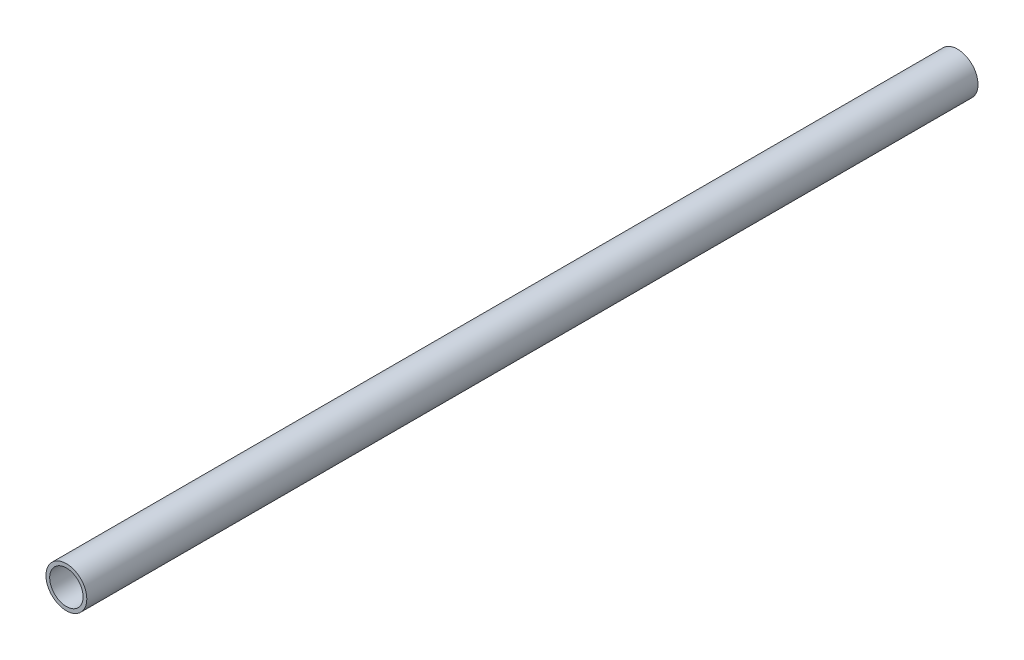
ISO-10303-21;
HEADER;
FILE_DESCRIPTION(('STEP AP214'),'2;1');
FILE_NAME('part.step','',(''),(''),'','','');
FILE_SCHEMA(('AUTOMOTIVE_DESIGN { 1 0 10303 214 1 1 1 1 }'));
ENDSEC;
DATA;
#1=APPLICATION_CONTEXT('core data for automotive mechanical design processes');
#2=APPLICATION_PROTOCOL_DEFINITION('international standard','automotive_design',2000,#1);
#3=PRODUCT_CONTEXT('',#1,'mechanical');
#4=PRODUCT('Part','Part','',(#3));
#5=PRODUCT_RELATED_PRODUCT_CATEGORY('part','',(#4));
#6=PRODUCT_DEFINITION_FORMATION('','',#4);
#7=PRODUCT_DEFINITION_CONTEXT('part definition',#1,'design');
#8=PRODUCT_DEFINITION('design','',#6,#7);
#9=PRODUCT_DEFINITION_SHAPE('','',#8);
#10=(LENGTH_UNIT() NAMED_UNIT(*) SI_UNIT(.MILLI.,.METRE.));
#11=(NAMED_UNIT(*) PLANE_ANGLE_UNIT() SI_UNIT($,.RADIAN.));
#12=(NAMED_UNIT(*) SI_UNIT($,.STERADIAN.) SOLID_ANGLE_UNIT());
#13=UNCERTAINTY_MEASURE_WITH_UNIT(LENGTH_MEASURE(1.E-05),#10,'distance_accuracy_value','');
#14=(GEOMETRIC_REPRESENTATION_CONTEXT(3) GLOBAL_UNCERTAINTY_ASSIGNED_CONTEXT((#13)) GLOBAL_UNIT_ASSIGNED_CONTEXT((#10,
#11,#12)) REPRESENTATION_CONTEXT('',''));
#15=CARTESIAN_POINT('',(0.,0.,0.));
#16=DIRECTION('',(0.,0.,1.));
#17=DIRECTION('',(1.,0.,0.));
#18=AXIS2_PLACEMENT_3D('',#15,#16,#17);
#19=CARTESIAN_POINT('',(0.,0.0153763312857481,240.));
#20=DIRECTION('',(0.,0.,1.));
#21=DIRECTION('',(1.,0.,0.));
#22=AXIS2_PLACEMENT_3D('',#19,#20,#21);
#23=PLANE('',#22);
#24=CARTESIAN_POINT('',(0.,0.0153763312857481,240.));
#25=DIRECTION('',(0.,0.,1.));
#26=DIRECTION('',(1.,0.,0.));
#27=AXIS2_PLACEMENT_3D('',#24,#25,#26);
#28=CIRCLE('',#27,5.5);
#29=CARTESIAN_POINT('',(5.50000000000001,0.0153763312857481,240.));
#30=VERTEX_POINT('',#29);
#31=EDGE_CURVE('E10',#30,#30,#28,.T.);
#32=ORIENTED_EDGE('',*,*,#31,.T.);
#33=EDGE_LOOP('',(#32));
#34=FACE_BOUND('',#33,.T.);
#35=CARTESIAN_POINT('',(0.,0.0153763312857481,240.));
#36=DIRECTION('',(0.,0.,1.));
#37=DIRECTION('',(1.,0.,0.));
#38=AXIS2_PLACEMENT_3D('',#35,#36,#37);
#39=CIRCLE('',#38,4.5);
#40=CARTESIAN_POINT('',(4.5,0.0153763312857481,240.));
#41=VERTEX_POINT('',#40);
#42=EDGE_CURVE('E54',#41,#41,#39,.T.);
#43=ORIENTED_EDGE('',*,*,#42,.F.);
#44=EDGE_LOOP('',(#43));
#45=FACE_BOUND('',#44,.T.);
#46=ADVANCED_FACE('F41',(#34,#45),#23,.T.);
#47=CARTESIAN_POINT('',(0.,0.0153763312857481,0.));
#48=DIRECTION('',(0.,0.,1.));
#49=DIRECTION('',(1.,0.,0.));
#50=AXIS2_PLACEMENT_3D('',#47,#48,#49);
#51=PLANE('',#50);
#52=CARTESIAN_POINT('',(0.,0.0153763312857481,0.));
#53=DIRECTION('',(0.,0.,1.));
#54=DIRECTION('',(1.,0.,0.));
#55=AXIS2_PLACEMENT_3D('',#52,#53,#54);
#56=CIRCLE('',#55,5.5);
#57=CARTESIAN_POINT('',(5.50000000000001,0.0153763312857481,0.));
#58=VERTEX_POINT('',#57);
#59=EDGE_CURVE('E45',#58,#58,#56,.T.);
#60=ORIENTED_EDGE('',*,*,#59,.F.);
#61=EDGE_LOOP('',(#60));
#62=FACE_BOUND('',#61,.T.);
#63=CARTESIAN_POINT('',(0.,0.0153763312857481,0.));
#64=DIRECTION('',(0.,0.,1.));
#65=DIRECTION('',(1.,0.,0.));
#66=AXIS2_PLACEMENT_3D('',#63,#64,#65);
#67=CIRCLE('',#66,4.5);
#68=CARTESIAN_POINT('',(4.5,0.0153763312857481,0.));
#69=VERTEX_POINT('',#68);
#70=EDGE_CURVE('E56',#69,#69,#67,.T.);
#71=ORIENTED_EDGE('',*,*,#70,.T.);
#72=EDGE_LOOP('',(#71));
#73=FACE_BOUND('',#72,.T.);
#74=ADVANCED_FACE('F68',(#62,#73),#51,.F.);
#75=CARTESIAN_POINT('',(0.,0.0153763312857481,240.));
#76=DIRECTION('',(0.,0.,-1.));
#77=DIRECTION('',(-1.,0.,0.));
#78=AXIS2_PLACEMENT_3D('',#75,#76,#77);
#79=CYLINDRICAL_SURFACE('',#78,5.5);
#80=ORIENTED_EDGE('',*,*,#31,.F.);
#81=EDGE_LOOP('',(#80));
#82=FACE_BOUND('',#81,.T.);
#83=ORIENTED_EDGE('',*,*,#59,.T.);
#84=EDGE_LOOP('',(#83));
#85=FACE_BOUND('',#84,.T.);
#86=ADVANCED_FACE('F43',(#82,#85),#79,.T.);
#87=CARTESIAN_POINT('',(0.,0.0153763312857481,240.));
#88=DIRECTION('',(0.,0.,-1.));
#89=DIRECTION('',(-1.,0.,0.));
#90=AXIS2_PLACEMENT_3D('',#87,#88,#89);
#91=CYLINDRICAL_SURFACE('',#90,4.5);
#92=ORIENTED_EDGE('',*,*,#42,.T.);
#93=EDGE_LOOP('',(#92));
#94=FACE_BOUND('',#93,.T.);
#95=ORIENTED_EDGE('',*,*,#70,.F.);
#96=EDGE_LOOP('',(#95));
#97=FACE_BOUND('',#96,.T.);
#98=ADVANCED_FACE('F64',(#94,#97),#91,.F.);
#99=CLOSED_SHELL('',(#46,#74,#86,#98));
#100=MANIFOLD_SOLID_BREP('B2',#99);
#101=ADVANCED_BREP_SHAPE_REPRESENTATION('',(#18,#100),#14);
#102=SHAPE_DEFINITION_REPRESENTATION(#9,#101);
ENDSEC;
END-ISO-10303-21;
